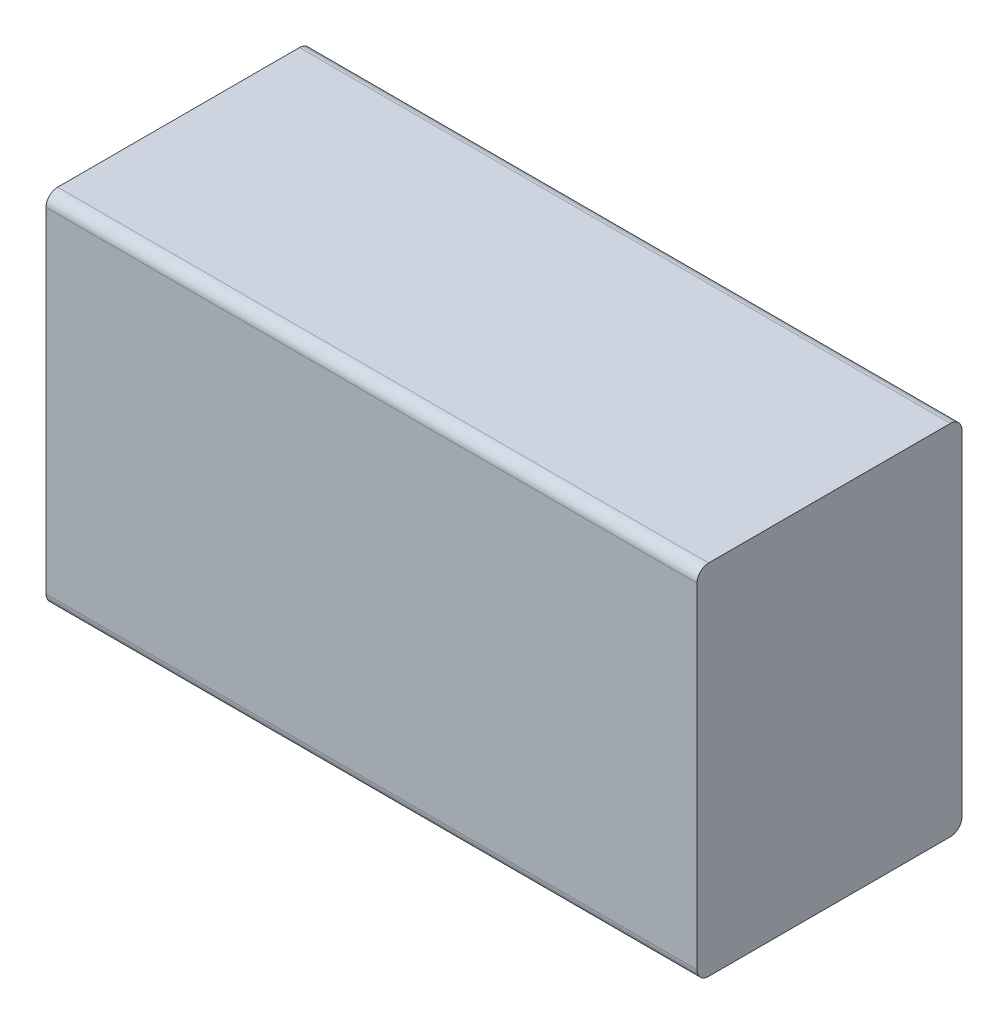
ISO-10303-21;
HEADER;
FILE_DESCRIPTION(('STEP AP214'),'2;1');
FILE_NAME('part.step','',(''),(''),'','','');
FILE_SCHEMA(('AUTOMOTIVE_DESIGN { 1 0 10303 214 1 1 1 1 }'));
ENDSEC;
DATA;
#1=APPLICATION_CONTEXT('core data for automotive mechanical design processes');
#2=APPLICATION_PROTOCOL_DEFINITION('international standard','automotive_design',2000,#1);
#3=PRODUCT_CONTEXT('',#1,'mechanical');
#4=PRODUCT('Part','Part','',(#3));
#5=PRODUCT_RELATED_PRODUCT_CATEGORY('part','',(#4));
#6=PRODUCT_DEFINITION_FORMATION('','',#4);
#7=PRODUCT_DEFINITION_CONTEXT('part definition',#1,'design');
#8=PRODUCT_DEFINITION('design','',#6,#7);
#9=PRODUCT_DEFINITION_SHAPE('','',#8);
#10=(LENGTH_UNIT() NAMED_UNIT(*) SI_UNIT(.MILLI.,.METRE.));
#11=(NAMED_UNIT(*) PLANE_ANGLE_UNIT() SI_UNIT($,.RADIAN.));
#12=(NAMED_UNIT(*) SI_UNIT($,.STERADIAN.) SOLID_ANGLE_UNIT());
#13=UNCERTAINTY_MEASURE_WITH_UNIT(LENGTH_MEASURE(1.E-05),#10,'distance_accuracy_value','');
#14=(GEOMETRIC_REPRESENTATION_CONTEXT(3) GLOBAL_UNCERTAINTY_ASSIGNED_CONTEXT((#13)) GLOBAL_UNIT_ASSIGNED_CONTEXT((#10,
#11,#12)) REPRESENTATION_CONTEXT('',''));
#15=CARTESIAN_POINT('',(0.,0.,0.));
#16=DIRECTION('',(0.,0.,1.));
#17=DIRECTION('',(1.,0.,0.));
#18=AXIS2_PLACEMENT_3D('',#15,#16,#17);
#19=CARTESIAN_POINT('',(0.,0.36,0.04));
#20=DIRECTION('',(1.,0.,0.));
#21=DIRECTION('',(0.,0.,-1.));
#22=AXIS2_PLACEMENT_3D('',#19,#20,#21);
#23=CYLINDRICAL_SURFACE('',#22,0.025);
#24=CARTESIAN_POINT('',(-0.7,0.36,0.04));
#25=DIRECTION('',(1.,0.,0.));
#26=DIRECTION('',(0.,0.,-1.));
#27=AXIS2_PLACEMENT_3D('',#24,#25,#26);
#28=CIRCLE('',#27,0.025);
#29=CARTESIAN_POINT('',(-0.7,0.36,0.015));
#30=VERTEX_POINT('',#29);
#31=CARTESIAN_POINT('',(-0.7,0.385,0.04));
#32=VERTEX_POINT('',#31);
#33=EDGE_CURVE('E93',#30,#32,#28,.T.);
#34=ORIENTED_EDGE('',*,*,#33,.T.);
#35=DIRECTION('',(1.,0.,0.));
#36=VECTOR('',#35,1.);
#37=CARTESIAN_POINT('',(0.,0.385,0.04));
#38=LINE('',#37,#36);
#39=CARTESIAN_POINT('',(0.7,0.385,0.04));
#40=VERTEX_POINT('',#39);
#41=EDGE_CURVE('E79',#40,#32,#38,.F.);
#42=ORIENTED_EDGE('',*,*,#41,.F.);
#43=CARTESIAN_POINT('',(0.7,0.36,0.04));
#44=DIRECTION('',(1.,0.,0.));
#45=DIRECTION('',(0.,0.,-1.));
#46=AXIS2_PLACEMENT_3D('',#43,#44,#45);
#47=CIRCLE('',#46,0.025);
#48=CARTESIAN_POINT('',(0.7,0.36,0.015));
#49=VERTEX_POINT('',#48);
#50=EDGE_CURVE('E20',#40,#49,#47,.F.);
#51=ORIENTED_EDGE('',*,*,#50,.T.);
#52=DIRECTION('',(-1.,0.,0.));
#53=VECTOR('',#52,1.);
#54=CARTESIAN_POINT('',(0.,0.36,0.015));
#55=LINE('',#54,#53);
#56=EDGE_CURVE('E94',#30,#49,#55,.F.);
#57=ORIENTED_EDGE('',*,*,#56,.F.);
#58=EDGE_LOOP('',(#34,#42,#51,#57));
#59=FACE_BOUND('',#58,.T.);
#60=ADVANCED_FACE('F17',(#59),#23,.T.);
#61=CARTESIAN_POINT('',(0.,-0.36,0.04));
#62=DIRECTION('',(1.,0.,0.));
#63=DIRECTION('',(0.,0.,-1.));
#64=AXIS2_PLACEMENT_3D('',#61,#62,#63);
#65=CYLINDRICAL_SURFACE('',#64,0.025);
#66=CARTESIAN_POINT('',(-0.7,-0.36,0.04));
#67=DIRECTION('',(1.,0.,0.));
#68=DIRECTION('',(0.,0.,-1.));
#69=AXIS2_PLACEMENT_3D('',#66,#67,#68);
#70=CIRCLE('',#69,0.025);
#71=CARTESIAN_POINT('',(-0.7,-0.385,0.04));
#72=VERTEX_POINT('',#71);
#73=CARTESIAN_POINT('',(-0.7,-0.36,0.015));
#74=VERTEX_POINT('',#73);
#75=EDGE_CURVE('E104',#72,#74,#70,.T.);
#76=ORIENTED_EDGE('',*,*,#75,.T.);
#77=DIRECTION('',(-1.,0.,0.));
#78=VECTOR('',#77,1.);
#79=CARTESIAN_POINT('',(0.,-0.36,0.015));
#80=LINE('',#79,#78);
#81=CARTESIAN_POINT('',(0.7,-0.36,0.015));
#82=VERTEX_POINT('',#81);
#83=EDGE_CURVE('E96',#82,#74,#80,.T.);
#84=ORIENTED_EDGE('',*,*,#83,.F.);
#85=CARTESIAN_POINT('',(0.7,-0.36,0.04));
#86=DIRECTION('',(1.,0.,0.));
#87=DIRECTION('',(0.,0.,-1.));
#88=AXIS2_PLACEMENT_3D('',#85,#86,#87);
#89=CIRCLE('',#88,0.025);
#90=CARTESIAN_POINT('',(0.7,-0.385,0.04));
#91=VERTEX_POINT('',#90);
#92=EDGE_CURVE('E120',#82,#91,#89,.F.);
#93=ORIENTED_EDGE('',*,*,#92,.T.);
#94=DIRECTION('',(1.,0.,0.));
#95=VECTOR('',#94,1.);
#96=CARTESIAN_POINT('',(0.,-0.385,0.04));
#97=LINE('',#96,#95);
#98=EDGE_CURVE('E82',#72,#91,#97,.T.);
#99=ORIENTED_EDGE('',*,*,#98,.F.);
#100=EDGE_LOOP('',(#76,#84,#93,#99));
#101=FACE_BOUND('',#100,.T.);
#102=ADVANCED_FACE('F124',(#101),#65,.T.);
#103=CARTESIAN_POINT('',(0.,-0.385,0.3));
#104=DIRECTION('',(0.,-1.,0.));
#105=DIRECTION('',(0.,0.,-1.));
#106=AXIS2_PLACEMENT_3D('',#103,#104,#105);
#107=PLANE('',#106);
#108=DIRECTION('',(0.,0.,-1.));
#109=VECTOR('',#108,1.);
#110=CARTESIAN_POINT('',(-0.7,-0.385,0.3));
#111=LINE('',#110,#109);
#112=CARTESIAN_POINT('',(-0.7,-0.385,0.56));
#113=VERTEX_POINT('',#112);
#114=EDGE_CURVE('E99',#113,#72,#111,.T.);
#115=ORIENTED_EDGE('',*,*,#114,.T.);
#116=ORIENTED_EDGE('',*,*,#98,.T.);
#117=DIRECTION('',(0.,0.,-1.));
#118=VECTOR('',#117,1.);
#119=CARTESIAN_POINT('',(0.7,-0.385,0.3));
#120=LINE('',#119,#118);
#121=CARTESIAN_POINT('',(0.7,-0.385,0.56));
#122=VERTEX_POINT('',#121);
#123=EDGE_CURVE('E101',#91,#122,#120,.F.);
#124=ORIENTED_EDGE('',*,*,#123,.T.);
#125=DIRECTION('',(-1.,0.,0.));
#126=VECTOR('',#125,1.);
#127=CARTESIAN_POINT('',(0.,-0.385,0.56));
#128=LINE('',#127,#126);
#129=EDGE_CURVE('E118',#113,#122,#128,.F.);
#130=ORIENTED_EDGE('',*,*,#129,.F.);
#131=EDGE_LOOP('',(#115,#116,#124,#130));
#132=FACE_BOUND('',#131,.T.);
#133=ADVANCED_FACE('F127',(#132),#107,.T.);
#134=CARTESIAN_POINT('',(0.,0.385,0.3));
#135=DIRECTION('',(0.,1.,0.));
#136=DIRECTION('',(0.,0.,1.));
#137=AXIS2_PLACEMENT_3D('',#134,#135,#136);
#138=PLANE('',#137);
#139=DIRECTION('',(0.,0.,-1.));
#140=VECTOR('',#139,1.);
#141=CARTESIAN_POINT('',(-0.7,0.385,0.3));
#142=LINE('',#141,#140);
#143=CARTESIAN_POINT('',(-0.7,0.385,0.56));
#144=VERTEX_POINT('',#143);
#145=EDGE_CURVE('E149',#32,#144,#142,.F.);
#146=ORIENTED_EDGE('',*,*,#145,.T.);
#147=DIRECTION('',(-1.,0.,0.));
#148=VECTOR('',#147,1.);
#149=CARTESIAN_POINT('',(0.,0.385,0.56));
#150=LINE('',#149,#148);
#151=CARTESIAN_POINT('',(0.7,0.385,0.56));
#152=VERTEX_POINT('',#151);
#153=EDGE_CURVE('E81',#152,#144,#150,.T.);
#154=ORIENTED_EDGE('',*,*,#153,.F.);
#155=DIRECTION('',(0.,0.,1.));
#156=VECTOR('',#155,1.);
#157=CARTESIAN_POINT('',(0.7,0.385,0.3));
#158=LINE('',#157,#156);
#159=EDGE_CURVE('E74',#152,#40,#158,.F.);
#160=ORIENTED_EDGE('',*,*,#159,.T.);
#161=ORIENTED_EDGE('',*,*,#41,.T.);
#162=EDGE_LOOP('',(#146,#154,#160,#161));
#163=FACE_BOUND('',#162,.T.);
#164=ADVANCED_FACE('F77',(#163),#138,.T.);
#165=CARTESIAN_POINT('',(0.,-0.385,0.015));
#166=DIRECTION('',(0.,0.,-1.));
#167=DIRECTION('',(-1.,0.,0.));
#168=AXIS2_PLACEMENT_3D('',#165,#166,#167);
#169=PLANE('',#168);
#170=DIRECTION('',(0.,1.,0.));
#171=VECTOR('',#170,1.);
#172=CARTESIAN_POINT('',(0.7,-0.385,0.015));
#173=LINE('',#172,#171);
#174=EDGE_CURVE('E89',#82,#49,#173,.T.);
#175=ORIENTED_EDGE('',*,*,#174,.F.);
#176=ORIENTED_EDGE('',*,*,#83,.T.);
#177=DIRECTION('',(0.,1.,0.));
#178=VECTOR('',#177,1.);
#179=CARTESIAN_POINT('',(-0.7,-0.385,0.015));
#180=LINE('',#179,#178);
#181=EDGE_CURVE('E117',#74,#30,#180,.T.);
#182=ORIENTED_EDGE('',*,*,#181,.T.);
#183=ORIENTED_EDGE('',*,*,#56,.T.);
#184=EDGE_LOOP('',(#175,#176,#182,#183));
#185=FACE_BOUND('',#184,.T.);
#186=ADVANCED_FACE('F157',(#185),#169,.T.);
#187=CARTESIAN_POINT('',(0.,-0.36,0.56));
#188=DIRECTION('',(-1.,0.,0.));
#189=DIRECTION('',(0.,0.,1.));
#190=AXIS2_PLACEMENT_3D('',#187,#188,#189);
#191=CYLINDRICAL_SURFACE('',#190,0.025);
#192=CARTESIAN_POINT('',(-0.7,-0.36,0.56));
#193=DIRECTION('',(-1.,0.,0.));
#194=DIRECTION('',(0.,0.,1.));
#195=AXIS2_PLACEMENT_3D('',#192,#193,#194);
#196=CIRCLE('',#195,0.025);
#197=CARTESIAN_POINT('',(-0.7,-0.36,0.585));
#198=VERTEX_POINT('',#197);
#199=EDGE_CURVE('E114',#198,#113,#196,.F.);
#200=ORIENTED_EDGE('',*,*,#199,.T.);
#201=ORIENTED_EDGE('',*,*,#129,.T.);
#202=CARTESIAN_POINT('',(0.7,-0.36,0.56));
#203=DIRECTION('',(-1.,0.,0.));
#204=DIRECTION('',(0.,0.,1.));
#205=AXIS2_PLACEMENT_3D('',#202,#203,#204);
#206=CIRCLE('',#205,0.025);
#207=CARTESIAN_POINT('',(0.7,-0.36,0.585));
#208=VERTEX_POINT('',#207);
#209=EDGE_CURVE('E107',#208,#122,#206,.F.);
#210=ORIENTED_EDGE('',*,*,#209,.F.);
#211=DIRECTION('',(-1.,0.,0.));
#212=VECTOR('',#211,1.);
#213=CARTESIAN_POINT('',(0.,-0.36,0.585));
#214=LINE('',#213,#212);
#215=EDGE_CURVE('E110',#208,#198,#214,.T.);
#216=ORIENTED_EDGE('',*,*,#215,.T.);
#217=EDGE_LOOP('',(#200,#201,#210,#216));
#218=FACE_BOUND('',#217,.T.);
#219=ADVANCED_FACE('F135',(#218),#191,.T.);
#220=CARTESIAN_POINT('',(-0.7,-0.385,0.3));
#221=DIRECTION('',(1.,0.,0.));
#222=DIRECTION('',(0.,0.,-1.));
#223=AXIS2_PLACEMENT_3D('',#220,#221,#222);
#224=PLANE('',#223);
#225=ORIENTED_EDGE('',*,*,#33,.F.);
#226=ORIENTED_EDGE('',*,*,#181,.F.);
#227=ORIENTED_EDGE('',*,*,#75,.F.);
#228=ORIENTED_EDGE('',*,*,#114,.F.);
#229=ORIENTED_EDGE('',*,*,#199,.F.);
#230=DIRECTION('',(0.,1.,0.));
#231=VECTOR('',#230,1.);
#232=CARTESIAN_POINT('',(-0.7,-0.385,0.585));
#233=LINE('',#232,#231);
#234=CARTESIAN_POINT('',(-0.7,0.36,0.585));
#235=VERTEX_POINT('',#234);
#236=EDGE_CURVE('E144',#198,#235,#233,.T.);
#237=ORIENTED_EDGE('',*,*,#236,.T.);
#238=CARTESIAN_POINT('',(-0.7,0.36,0.56));
#239=DIRECTION('',(-1.,0.,0.));
#240=DIRECTION('',(0.,0.,1.));
#241=AXIS2_PLACEMENT_3D('',#238,#239,#240);
#242=CIRCLE('',#241,0.025);
#243=EDGE_CURVE('E112',#144,#235,#242,.F.);
#244=ORIENTED_EDGE('',*,*,#243,.F.);
#245=ORIENTED_EDGE('',*,*,#145,.F.);
#246=EDGE_LOOP('',(#225,#226,#227,#228,#229,#237,#244,#245));
#247=FACE_BOUND('',#246,.T.);
#248=ADVANCED_FACE('F159',(#247),#224,.F.);
#249=CARTESIAN_POINT('',(0.,0.36,0.56));
#250=DIRECTION('',(-1.,0.,0.));
#251=DIRECTION('',(0.,0.,1.));
#252=AXIS2_PLACEMENT_3D('',#249,#250,#251);
#253=CYLINDRICAL_SURFACE('',#252,0.025);
#254=ORIENTED_EDGE('',*,*,#243,.T.);
#255=DIRECTION('',(-1.,0.,0.));
#256=VECTOR('',#255,1.);
#257=CARTESIAN_POINT('',(0.,0.36,0.585));
#258=LINE('',#257,#256);
#259=CARTESIAN_POINT('',(0.7,0.36,0.585));
#260=VERTEX_POINT('',#259);
#261=EDGE_CURVE('E26',#235,#260,#258,.F.);
#262=ORIENTED_EDGE('',*,*,#261,.T.);
#263=CARTESIAN_POINT('',(0.7,0.36,0.56));
#264=DIRECTION('',(-1.,0.,0.));
#265=DIRECTION('',(0.,0.,1.));
#266=AXIS2_PLACEMENT_3D('',#263,#264,#265);
#267=CIRCLE('',#266,0.025);
#268=EDGE_CURVE('E34',#152,#260,#267,.F.);
#269=ORIENTED_EDGE('',*,*,#268,.F.);
#270=ORIENTED_EDGE('',*,*,#153,.T.);
#271=EDGE_LOOP('',(#254,#262,#269,#270));
#272=FACE_BOUND('',#271,.T.);
#273=ADVANCED_FACE('F162',(#272),#253,.T.);
#274=CARTESIAN_POINT('',(0.7,-0.385,0.3));
#275=DIRECTION('',(1.,0.,0.));
#276=DIRECTION('',(0.,0.,-1.));
#277=AXIS2_PLACEMENT_3D('',#274,#275,#276);
#278=PLANE('',#277);
#279=ORIENTED_EDGE('',*,*,#123,.F.);
#280=ORIENTED_EDGE('',*,*,#92,.F.);
#281=ORIENTED_EDGE('',*,*,#174,.T.);
#282=ORIENTED_EDGE('',*,*,#50,.F.);
#283=ORIENTED_EDGE('',*,*,#159,.F.);
#284=ORIENTED_EDGE('',*,*,#268,.T.);
#285=DIRECTION('',(0.,1.,0.));
#286=VECTOR('',#285,1.);
#287=CARTESIAN_POINT('',(0.7,-0.385,0.585));
#288=LINE('',#287,#286);
#289=EDGE_CURVE('E11',#260,#208,#288,.F.);
#290=ORIENTED_EDGE('',*,*,#289,.T.);
#291=ORIENTED_EDGE('',*,*,#209,.T.);
#292=EDGE_LOOP('',(#279,#280,#281,#282,#283,#284,#290,#291));
#293=FACE_BOUND('',#292,.T.);
#294=ADVANCED_FACE('F87',(#293),#278,.T.);
#295=CARTESIAN_POINT('',(0.,-0.385,0.585));
#296=DIRECTION('',(0.,0.,-1.));
#297=DIRECTION('',(-1.,0.,0.));
#298=AXIS2_PLACEMENT_3D('',#295,#296,#297);
#299=PLANE('',#298);
#300=ORIENTED_EDGE('',*,*,#261,.F.);
#301=ORIENTED_EDGE('',*,*,#236,.F.);
#302=ORIENTED_EDGE('',*,*,#215,.F.);
#303=ORIENTED_EDGE('',*,*,#289,.F.);
#304=EDGE_LOOP('',(#300,#301,#302,#303));
#305=FACE_BOUND('',#304,.T.);
#306=ADVANCED_FACE('F141',(#305),#299,.F.);
#307=CLOSED_SHELL('',(#60,#102,#133,#164,#186,#219,#248,#273,#294,#306));
#308=MANIFOLD_SOLID_BREP('B1',#307);
#309=ADVANCED_BREP_SHAPE_REPRESENTATION('',(#18,#308),#14);
#310=SHAPE_DEFINITION_REPRESENTATION(#9,#309);
ENDSEC;
END-ISO-10303-21;
